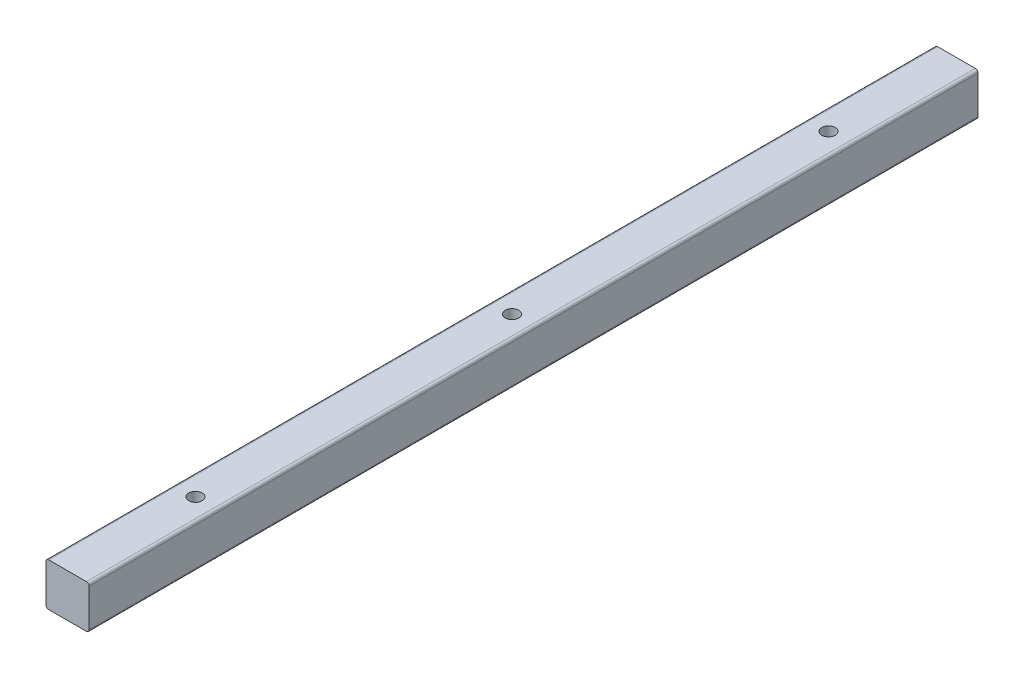
ISO-10303-21;
HEADER;
FILE_DESCRIPTION(('STEP AP214'),'2;1');
FILE_NAME('part.step','',(''),(''),'','','');
FILE_SCHEMA(('AUTOMOTIVE_DESIGN { 1 0 10303 214 1 1 1 1 }'));
ENDSEC;
DATA;
#1=APPLICATION_CONTEXT('core data for automotive mechanical design processes');
#2=APPLICATION_PROTOCOL_DEFINITION('international standard','automotive_design',2000,#1);
#3=PRODUCT_CONTEXT('',#1,'mechanical');
#4=PRODUCT('Part','Part','',(#3));
#5=PRODUCT_RELATED_PRODUCT_CATEGORY('part','',(#4));
#6=PRODUCT_DEFINITION_FORMATION('','',#4);
#7=PRODUCT_DEFINITION_CONTEXT('part definition',#1,'design');
#8=PRODUCT_DEFINITION('design','',#6,#7);
#9=PRODUCT_DEFINITION_SHAPE('','',#8);
#10=(LENGTH_UNIT() NAMED_UNIT(*) SI_UNIT(.MILLI.,.METRE.));
#11=(NAMED_UNIT(*) PLANE_ANGLE_UNIT() SI_UNIT($,.RADIAN.));
#12=(NAMED_UNIT(*) SI_UNIT($,.STERADIAN.) SOLID_ANGLE_UNIT());
#13=UNCERTAINTY_MEASURE_WITH_UNIT(LENGTH_MEASURE(1.E-05),#10,'distance_accuracy_value','');
#14=(GEOMETRIC_REPRESENTATION_CONTEXT(3) GLOBAL_UNCERTAINTY_ASSIGNED_CONTEXT((#13)) GLOBAL_UNIT_ASSIGNED_CONTEXT((#10,
#11,#12)) REPRESENTATION_CONTEXT('',''));
#15=CARTESIAN_POINT('',(0.,0.,0.));
#16=DIRECTION('',(0.,0.,1.));
#17=DIRECTION('',(1.,0.,0.));
#18=AXIS2_PLACEMENT_3D('',#15,#16,#17);
#19=CARTESIAN_POINT('',(-7.,-7.,165.));
#20=DIRECTION('',(0.,0.,-1.));
#21=DIRECTION('',(-1.,0.,0.));
#22=AXIS2_PLACEMENT_3D('',#19,#20,#21);
#23=CYLINDRICAL_SURFACE('',#22,1.);
#24=CARTESIAN_POINT('',(-7.,-7.,-165.));
#25=DIRECTION('',(0.,0.,1.));
#26=DIRECTION('',(-1.,0.,0.));
#27=AXIS2_PLACEMENT_3D('',#24,#25,#26);
#28=CIRCLE('',#27,1.);
#29=CARTESIAN_POINT('',(-8.,-6.99999999999999,-165.));
#30=VERTEX_POINT('',#29);
#31=CARTESIAN_POINT('',(-6.99999999999999,-8.,-165.));
#32=VERTEX_POINT('',#31);
#33=EDGE_CURVE('E135',#30,#32,#28,.T.);
#34=ORIENTED_EDGE('',*,*,#33,.T.);
#35=DIRECTION('',(0.,0.,-1.));
#36=VECTOR('',#35,1.);
#37=CARTESIAN_POINT('',(-6.99999999999999,-8.,165.));
#38=LINE('',#37,#36);
#39=CARTESIAN_POINT('',(-6.99999999999999,-8.,165.));
#40=VERTEX_POINT('',#39);
#41=EDGE_CURVE('E11',#40,#32,#38,.T.);
#42=ORIENTED_EDGE('',*,*,#41,.F.);
#43=CARTESIAN_POINT('',(-7.,-7.,165.));
#44=DIRECTION('',(0.,0.,1.));
#45=DIRECTION('',(-1.,0.,0.));
#46=AXIS2_PLACEMENT_3D('',#43,#44,#45);
#47=CIRCLE('',#46,1.);
#48=CARTESIAN_POINT('',(-8.,-6.99999999999999,165.));
#49=VERTEX_POINT('',#48);
#50=EDGE_CURVE('E150',#49,#40,#47,.T.);
#51=ORIENTED_EDGE('',*,*,#50,.F.);
#52=DIRECTION('',(0.,0.,-1.));
#53=VECTOR('',#52,1.);
#54=CARTESIAN_POINT('',(-8.,-6.99999999999999,165.));
#55=LINE('',#54,#53);
#56=EDGE_CURVE('E131',#49,#30,#55,.T.);
#57=ORIENTED_EDGE('',*,*,#56,.T.);
#58=EDGE_LOOP('',(#34,#42,#51,#57));
#59=FACE_BOUND('',#58,.T.);
#60=ADVANCED_FACE('F36',(#59),#23,.T.);
#61=CARTESIAN_POINT('',(6.99999999999999,-8.,165.));
#62=DIRECTION('',(0.,1.,0.));
#63=DIRECTION('',(-1.,0.,0.));
#64=AXIS2_PLACEMENT_3D('',#61,#62,#63);
#65=PLANE('',#64);
#66=CARTESIAN_POINT('',(0.,-8.,-10.));
#67=DIRECTION('',(0.,-1.,0.));
#68=DIRECTION('',(0.,0.,-1.));
#69=AXIS2_PLACEMENT_3D('',#66,#67,#68);
#70=CIRCLE('',#69,1.25);
#71=CARTESIAN_POINT('',(0.,-8.,-11.25));
#72=VERTEX_POINT('',#71);
#73=EDGE_CURVE('E209',#72,#72,#70,.T.);
#74=ORIENTED_EDGE('',*,*,#73,.F.);
#75=EDGE_LOOP('',(#74));
#76=FACE_BOUND('',#75,.T.);
#77=CARTESIAN_POINT('',(0.,-8.,-50.));
#78=DIRECTION('',(0.,-1.,0.));
#79=DIRECTION('',(0.,0.,-1.));
#80=AXIS2_PLACEMENT_3D('',#77,#78,#79);
#81=CIRCLE('',#80,1.25);
#82=CARTESIAN_POINT('',(0.,-8.,-51.25));
#83=VERTEX_POINT('',#82);
#84=EDGE_CURVE('E203',#83,#83,#81,.T.);
#85=ORIENTED_EDGE('',*,*,#84,.F.);
#86=EDGE_LOOP('',(#85));
#87=FACE_BOUND('',#86,.T.);
#88=DIRECTION('',(1.,0.,0.));
#89=VECTOR('',#88,1.);
#90=CARTESIAN_POINT('',(6.99999999999999,-8.,-165.));
#91=LINE('',#90,#89);
#92=CARTESIAN_POINT('',(6.99999999999999,-8.,-165.));
#93=VERTEX_POINT('',#92);
#94=EDGE_CURVE('E138',#32,#93,#91,.T.);
#95=ORIENTED_EDGE('',*,*,#94,.T.);
#96=DIRECTION('',(0.,0.,-1.));
#97=VECTOR('',#96,1.);
#98=CARTESIAN_POINT('',(6.99999999999999,-8.,165.));
#99=LINE('',#98,#97);
#100=CARTESIAN_POINT('',(6.99999999999999,-8.,165.));
#101=VERTEX_POINT('',#100);
#102=EDGE_CURVE('E44',#101,#93,#99,.T.);
#103=ORIENTED_EDGE('',*,*,#102,.F.);
#104=DIRECTION('',(1.,0.,0.));
#105=VECTOR('',#104,1.);
#106=CARTESIAN_POINT('',(6.99999999999999,-8.,165.));
#107=LINE('',#106,#105);
#108=EDGE_CURVE('E96',#40,#101,#107,.T.);
#109=ORIENTED_EDGE('',*,*,#108,.F.);
#110=ORIENTED_EDGE('',*,*,#41,.T.);
#111=EDGE_LOOP('',(#95,#103,#109,#110));
#112=FACE_BOUND('',#111,.T.);
#113=ADVANCED_FACE('F215',(#76,#87,#112),#65,.F.);
#114=CARTESIAN_POINT('',(7.,-7.,165.));
#115=DIRECTION('',(0.,0.,-1.));
#116=DIRECTION('',(-1.,0.,0.));
#117=AXIS2_PLACEMENT_3D('',#114,#115,#116);
#118=CYLINDRICAL_SURFACE('',#117,1.);
#119=CARTESIAN_POINT('',(7.,-7.,-165.));
#120=DIRECTION('',(0.,0.,1.));
#121=DIRECTION('',(-1.,0.,0.));
#122=AXIS2_PLACEMENT_3D('',#119,#120,#121);
#123=CIRCLE('',#122,1.);
#124=CARTESIAN_POINT('',(8.,-6.99999999999999,-165.));
#125=VERTEX_POINT('',#124);
#126=EDGE_CURVE('E141',#93,#125,#123,.T.);
#127=ORIENTED_EDGE('',*,*,#126,.T.);
#128=DIRECTION('',(0.,0.,-1.));
#129=VECTOR('',#128,1.);
#130=CARTESIAN_POINT('',(8.,-6.99999999999999,165.));
#131=LINE('',#130,#129);
#132=CARTESIAN_POINT('',(8.,-6.99999999999999,165.));
#133=VERTEX_POINT('',#132);
#134=EDGE_CURVE('E157',#133,#125,#131,.T.);
#135=ORIENTED_EDGE('',*,*,#134,.F.);
#136=CARTESIAN_POINT('',(7.,-7.,165.));
#137=DIRECTION('',(0.,0.,1.));
#138=DIRECTION('',(-1.,0.,0.));
#139=AXIS2_PLACEMENT_3D('',#136,#137,#138);
#140=CIRCLE('',#139,1.);
#141=EDGE_CURVE('E165',#101,#133,#140,.T.);
#142=ORIENTED_EDGE('',*,*,#141,.F.);
#143=ORIENTED_EDGE('',*,*,#102,.T.);
#144=EDGE_LOOP('',(#127,#135,#142,#143));
#145=FACE_BOUND('',#144,.T.);
#146=ADVANCED_FACE('F163',(#145),#118,.T.);
#147=CARTESIAN_POINT('',(8.,6.99999999999999,165.));
#148=DIRECTION('',(-1.,0.,0.));
#149=DIRECTION('',(0.,-1.,0.));
#150=AXIS2_PLACEMENT_3D('',#147,#148,#149);
#151=PLANE('',#150);
#152=DIRECTION('',(0.,1.,0.));
#153=VECTOR('',#152,1.);
#154=CARTESIAN_POINT('',(8.,6.99999999999999,-165.));
#155=LINE('',#154,#153);
#156=CARTESIAN_POINT('',(8.,6.99999999999999,-165.));
#157=VERTEX_POINT('',#156);
#158=EDGE_CURVE('E143',#125,#157,#155,.T.);
#159=ORIENTED_EDGE('',*,*,#158,.T.);
#160=DIRECTION('',(0.,0.,-1.));
#161=VECTOR('',#160,1.);
#162=CARTESIAN_POINT('',(8.,6.99999999999999,165.));
#163=LINE('',#162,#161);
#164=CARTESIAN_POINT('',(8.,6.99999999999999,165.));
#165=VERTEX_POINT('',#164);
#166=EDGE_CURVE('E154',#165,#157,#163,.T.);
#167=ORIENTED_EDGE('',*,*,#166,.F.);
#168=DIRECTION('',(0.,1.,0.));
#169=VECTOR('',#168,1.);
#170=CARTESIAN_POINT('',(8.,6.99999999999999,165.));
#171=LINE('',#170,#169);
#172=EDGE_CURVE('E177',#133,#165,#171,.T.);
#173=ORIENTED_EDGE('',*,*,#172,.F.);
#174=ORIENTED_EDGE('',*,*,#134,.T.);
#175=EDGE_LOOP('',(#159,#167,#173,#174));
#176=FACE_BOUND('',#175,.T.);
#177=ADVANCED_FACE('F173',(#176),#151,.F.);
#178=CARTESIAN_POINT('',(7.,7.,165.));
#179=DIRECTION('',(0.,0.,-1.));
#180=DIRECTION('',(-1.,0.,0.));
#181=AXIS2_PLACEMENT_3D('',#178,#179,#180);
#182=CYLINDRICAL_SURFACE('',#181,1.);
#183=CARTESIAN_POINT('',(7.,7.,-165.));
#184=DIRECTION('',(0.,0.,1.));
#185=DIRECTION('',(-1.,0.,0.));
#186=AXIS2_PLACEMENT_3D('',#183,#184,#185);
#187=CIRCLE('',#186,1.);
#188=CARTESIAN_POINT('',(6.99999999999999,8.,-165.));
#189=VERTEX_POINT('',#188);
#190=EDGE_CURVE('E145',#157,#189,#187,.T.);
#191=ORIENTED_EDGE('',*,*,#190,.T.);
#192=DIRECTION('',(0.,0.,-1.));
#193=VECTOR('',#192,1.);
#194=CARTESIAN_POINT('',(6.99999999999999,8.,165.));
#195=LINE('',#194,#193);
#196=CARTESIAN_POINT('',(6.99999999999999,8.,165.));
#197=VERTEX_POINT('',#196);
#198=EDGE_CURVE('E126',#197,#189,#195,.T.);
#199=ORIENTED_EDGE('',*,*,#198,.F.);
#200=CARTESIAN_POINT('',(7.,7.,165.));
#201=DIRECTION('',(0.,0.,1.));
#202=DIRECTION('',(-1.,0.,0.));
#203=AXIS2_PLACEMENT_3D('',#200,#201,#202);
#204=CIRCLE('',#203,1.);
#205=EDGE_CURVE('E117',#165,#197,#204,.T.);
#206=ORIENTED_EDGE('',*,*,#205,.F.);
#207=ORIENTED_EDGE('',*,*,#166,.T.);
#208=EDGE_LOOP('',(#191,#199,#206,#207));
#209=FACE_BOUND('',#208,.T.);
#210=ADVANCED_FACE('F176',(#209),#182,.T.);
#211=CARTESIAN_POINT('',(6.99999999999999,8.,165.));
#212=DIRECTION('',(0.,-1.,0.));
#213=DIRECTION('',(0.,0.,-1.));
#214=AXIS2_PLACEMENT_3D('',#211,#212,#213);
#215=PLANE('',#214);
#216=CARTESIAN_POINT('',(0.,8.,0.));
#217=DIRECTION('',(0.,1.,0.));
#218=DIRECTION('',(0.,0.,1.));
#219=AXIS2_PLACEMENT_3D('',#216,#217,#218);
#220=CIRCLE('',#219,2.49999999999999);
#221=CARTESIAN_POINT('',(0.,8.,2.49999999999999));
#222=VERTEX_POINT('',#221);
#223=EDGE_CURVE('E197',#222,#222,#220,.T.);
#224=ORIENTED_EDGE('',*,*,#223,.F.);
#225=EDGE_LOOP('',(#224));
#226=FACE_BOUND('',#225,.T.);
#227=CARTESIAN_POINT('',(0.,8.,-117.5));
#228=DIRECTION('',(0.,1.,0.));
#229=DIRECTION('',(0.,0.,1.));
#230=AXIS2_PLACEMENT_3D('',#227,#228,#229);
#231=CIRCLE('',#230,2.49999999999999);
#232=CARTESIAN_POINT('',(0.,8.,-115.));
#233=VERTEX_POINT('',#232);
#234=EDGE_CURVE('E191',#233,#233,#231,.T.);
#235=ORIENTED_EDGE('',*,*,#234,.F.);
#236=EDGE_LOOP('',(#235));
#237=FACE_BOUND('',#236,.T.);
#238=CARTESIAN_POINT('',(0.,8.,117.5));
#239=DIRECTION('',(0.,1.,0.));
#240=DIRECTION('',(0.,0.,1.));
#241=AXIS2_PLACEMENT_3D('',#238,#239,#240);
#242=CIRCLE('',#241,2.49999999999999);
#243=CARTESIAN_POINT('',(0.,8.,120.));
#244=VERTEX_POINT('',#243);
#245=EDGE_CURVE('E185',#244,#244,#242,.T.);
#246=ORIENTED_EDGE('',*,*,#245,.F.);
#247=EDGE_LOOP('',(#246));
#248=FACE_BOUND('',#247,.T.);
#249=DIRECTION('',(-1.,0.,0.));
#250=VECTOR('',#249,1.);
#251=CARTESIAN_POINT('',(6.99999999999999,8.,-165.));
#252=LINE('',#251,#250);
#253=CARTESIAN_POINT('',(-7.,8.,-165.));
#254=VERTEX_POINT('',#253);
#255=EDGE_CURVE('E125',#189,#254,#252,.T.);
#256=ORIENTED_EDGE('',*,*,#255,.T.);
#257=DIRECTION('',(0.,0.,-1.));
#258=VECTOR('',#257,1.);
#259=CARTESIAN_POINT('',(-7.,8.,165.));
#260=LINE('',#259,#258);
#261=CARTESIAN_POINT('',(-7.,8.,165.));
#262=VERTEX_POINT('',#261);
#263=EDGE_CURVE('E122',#262,#254,#260,.T.);
#264=ORIENTED_EDGE('',*,*,#263,.F.);
#265=DIRECTION('',(-1.,0.,0.));
#266=VECTOR('',#265,1.);
#267=CARTESIAN_POINT('',(6.99999999999999,8.,165.));
#268=LINE('',#267,#266);
#269=EDGE_CURVE('E111',#197,#262,#268,.T.);
#270=ORIENTED_EDGE('',*,*,#269,.F.);
#271=ORIENTED_EDGE('',*,*,#198,.T.);
#272=EDGE_LOOP('',(#256,#264,#270,#271));
#273=FACE_BOUND('',#272,.T.);
#274=ADVANCED_FACE('F123',(#226,#237,#248,#273),#215,.F.);
#275=CARTESIAN_POINT('',(-7.,7.,165.));
#276=DIRECTION('',(0.,0.,-1.));
#277=DIRECTION('',(-1.,0.,0.));
#278=AXIS2_PLACEMENT_3D('',#275,#276,#277);
#279=CYLINDRICAL_SURFACE('',#278,1.);
#280=CARTESIAN_POINT('',(-7.,7.,-165.));
#281=DIRECTION('',(0.,0.,1.));
#282=DIRECTION('',(1.,0.,0.));
#283=AXIS2_PLACEMENT_3D('',#280,#281,#282);
#284=CIRCLE('',#283,1.);
#285=CARTESIAN_POINT('',(-8.,6.99999999999999,-165.));
#286=VERTEX_POINT('',#285);
#287=EDGE_CURVE('E82',#254,#286,#284,.T.);
#288=ORIENTED_EDGE('',*,*,#287,.T.);
#289=DIRECTION('',(0.,0.,-1.));
#290=VECTOR('',#289,1.);
#291=CARTESIAN_POINT('',(-8.,6.99999999999999,165.));
#292=LINE('',#291,#290);
#293=CARTESIAN_POINT('',(-8.,6.99999999999999,165.));
#294=VERTEX_POINT('',#293);
#295=EDGE_CURVE('E127',#294,#286,#292,.T.);
#296=ORIENTED_EDGE('',*,*,#295,.F.);
#297=CARTESIAN_POINT('',(-7.,7.,165.));
#298=DIRECTION('',(0.,0.,1.));
#299=DIRECTION('',(1.,0.,0.));
#300=AXIS2_PLACEMENT_3D('',#297,#298,#299);
#301=CIRCLE('',#300,1.);
#302=EDGE_CURVE('E115',#262,#294,#301,.T.);
#303=ORIENTED_EDGE('',*,*,#302,.F.);
#304=ORIENTED_EDGE('',*,*,#263,.T.);
#305=EDGE_LOOP('',(#288,#296,#303,#304));
#306=FACE_BOUND('',#305,.T.);
#307=ADVANCED_FACE('F129',(#306),#279,.T.);
#308=CARTESIAN_POINT('',(-8.,6.99999999999999,165.));
#309=DIRECTION('',(1.,0.,0.));
#310=DIRECTION('',(0.,1.,0.));
#311=AXIS2_PLACEMENT_3D('',#308,#309,#310);
#312=PLANE('',#311);
#313=DIRECTION('',(0.,-1.,0.));
#314=VECTOR('',#313,1.);
#315=CARTESIAN_POINT('',(-8.,6.99999999999999,-165.));
#316=LINE('',#315,#314);
#317=EDGE_CURVE('E88',#286,#30,#316,.T.);
#318=ORIENTED_EDGE('',*,*,#317,.T.);
#319=ORIENTED_EDGE('',*,*,#56,.F.);
#320=DIRECTION('',(0.,-1.,0.));
#321=VECTOR('',#320,1.);
#322=CARTESIAN_POINT('',(-8.,6.99999999999999,165.));
#323=LINE('',#322,#321);
#324=EDGE_CURVE('E52',#294,#49,#323,.T.);
#325=ORIENTED_EDGE('',*,*,#324,.F.);
#326=ORIENTED_EDGE('',*,*,#295,.T.);
#327=EDGE_LOOP('',(#318,#319,#325,#326));
#328=FACE_BOUND('',#327,.T.);
#329=ADVANCED_FACE('F222',(#328),#312,.F.);
#330=CARTESIAN_POINT('',(-7.,-7.,165.));
#331=DIRECTION('',(0.,0.,-1.));
#332=DIRECTION('',(-1.,0.,0.));
#333=AXIS2_PLACEMENT_3D('',#330,#331,#332);
#334=PLANE('',#333);
#335=ORIENTED_EDGE('',*,*,#50,.T.);
#336=ORIENTED_EDGE('',*,*,#108,.T.);
#337=ORIENTED_EDGE('',*,*,#141,.T.);
#338=ORIENTED_EDGE('',*,*,#172,.T.);
#339=ORIENTED_EDGE('',*,*,#205,.T.);
#340=ORIENTED_EDGE('',*,*,#269,.T.);
#341=ORIENTED_EDGE('',*,*,#302,.T.);
#342=ORIENTED_EDGE('',*,*,#324,.T.);
#343=EDGE_LOOP('',(#335,#336,#337,#338,#339,#340,#341,#342));
#344=FACE_BOUND('',#343,.T.);
#345=ADVANCED_FACE('F113',(#344),#334,.F.);
#346=CARTESIAN_POINT('',(-7.,-7.,-165.));
#347=DIRECTION('',(0.,0.,-1.));
#348=DIRECTION('',(-1.,0.,0.));
#349=AXIS2_PLACEMENT_3D('',#346,#347,#348);
#350=PLANE('',#349);
#351=ORIENTED_EDGE('',*,*,#33,.F.);
#352=ORIENTED_EDGE('',*,*,#317,.F.);
#353=ORIENTED_EDGE('',*,*,#287,.F.);
#354=ORIENTED_EDGE('',*,*,#255,.F.);
#355=ORIENTED_EDGE('',*,*,#190,.F.);
#356=ORIENTED_EDGE('',*,*,#158,.F.);
#357=ORIENTED_EDGE('',*,*,#126,.F.);
#358=ORIENTED_EDGE('',*,*,#94,.F.);
#359=EDGE_LOOP('',(#351,#352,#353,#354,#355,#356,#357,#358));
#360=FACE_BOUND('',#359,.T.);
#361=ADVANCED_FACE('F169',(#360),#350,.T.);
#362=CARTESIAN_POINT('',(0.,-5.,117.5));
#363=DIRECTION('',(0.,1.,0.));
#364=DIRECTION('',(0.,0.,1.));
#365=AXIS2_PLACEMENT_3D('',#362,#363,#364);
#366=CONICAL_SURFACE('',#365,2.5,1.02974425867665);
#367=CARTESIAN_POINT('',(0.,-6.5021515475689,117.5));
#368=VERTEX_POINT('',#367);
#369=VERTEX_LOOP('',#368);
#370=FACE_BOUND('',#369,.T.);
#371=CARTESIAN_POINT('',(0.,-5.,117.5));
#372=DIRECTION('',(0.,1.,0.));
#373=DIRECTION('',(0.,0.,1.));
#374=AXIS2_PLACEMENT_3D('',#371,#372,#373);
#375=CIRCLE('',#374,2.5);
#376=CARTESIAN_POINT('',(0.,-5.,120.));
#377=VERTEX_POINT('',#376);
#378=EDGE_CURVE('E139',#377,#377,#375,.T.);
#379=ORIENTED_EDGE('',*,*,#378,.T.);
#380=EDGE_LOOP('',(#379));
#381=FACE_BOUND('',#380,.T.);
#382=ADVANCED_FACE('F293',(#370,#381),#366,.F.);
#383=CARTESIAN_POINT('',(0.,8.,117.5));
#384=DIRECTION('',(0.,1.,0.));
#385=DIRECTION('',(0.,0.,1.));
#386=AXIS2_PLACEMENT_3D('',#383,#384,#385);
#387=CYLINDRICAL_SURFACE('',#386,2.49999999999999);
#388=ORIENTED_EDGE('',*,*,#378,.F.);
#389=EDGE_LOOP('',(#388));
#390=FACE_BOUND('',#389,.T.);
#391=ORIENTED_EDGE('',*,*,#245,.T.);
#392=EDGE_LOOP('',(#391));
#393=FACE_BOUND('',#392,.T.);
#394=ADVANCED_FACE('F301',(#390,#393),#387,.F.);
#395=CARTESIAN_POINT('',(0.,-5.,-117.5));
#396=DIRECTION('',(0.,1.,0.));
#397=DIRECTION('',(0.,0.,1.));
#398=AXIS2_PLACEMENT_3D('',#395,#396,#397);
#399=CONICAL_SURFACE('',#398,2.5,1.02974425867665);
#400=CARTESIAN_POINT('',(0.,-6.5021515475689,-117.5));
#401=VERTEX_POINT('',#400);
#402=VERTEX_LOOP('',#401);
#403=FACE_BOUND('',#402,.T.);
#404=CARTESIAN_POINT('',(0.,-5.,-117.5));
#405=DIRECTION('',(0.,1.,0.));
#406=DIRECTION('',(0.,0.,1.));
#407=AXIS2_PLACEMENT_3D('',#404,#405,#406);
#408=CIRCLE('',#407,2.5);
#409=CARTESIAN_POINT('',(0.,-5.,-115.));
#410=VERTEX_POINT('',#409);
#411=EDGE_CURVE('E188',#410,#410,#408,.T.);
#412=ORIENTED_EDGE('',*,*,#411,.T.);
#413=EDGE_LOOP('',(#412));
#414=FACE_BOUND('',#413,.T.);
#415=ADVANCED_FACE('F309',(#403,#414),#399,.F.);
#416=CARTESIAN_POINT('',(0.,8.,-117.5));
#417=DIRECTION('',(0.,1.,0.));
#418=DIRECTION('',(0.,0.,1.));
#419=AXIS2_PLACEMENT_3D('',#416,#417,#418);
#420=CYLINDRICAL_SURFACE('',#419,2.49999999999999);
#421=ORIENTED_EDGE('',*,*,#411,.F.);
#422=EDGE_LOOP('',(#421));
#423=FACE_BOUND('',#422,.T.);
#424=ORIENTED_EDGE('',*,*,#234,.T.);
#425=EDGE_LOOP('',(#424));
#426=FACE_BOUND('',#425,.T.);
#427=ADVANCED_FACE('F318',(#423,#426),#420,.F.);
#428=CARTESIAN_POINT('',(0.,-5.,0.));
#429=DIRECTION('',(0.,1.,0.));
#430=DIRECTION('',(0.,0.,1.));
#431=AXIS2_PLACEMENT_3D('',#428,#429,#430);
#432=CONICAL_SURFACE('',#431,2.5,1.02974425867665);
#433=CARTESIAN_POINT('',(0.,-6.5021515475689,0.));
#434=VERTEX_POINT('',#433);
#435=VERTEX_LOOP('',#434);
#436=FACE_BOUND('',#435,.T.);
#437=CARTESIAN_POINT('',(0.,-5.,0.));
#438=DIRECTION('',(0.,1.,0.));
#439=DIRECTION('',(0.,0.,1.));
#440=AXIS2_PLACEMENT_3D('',#437,#438,#439);
#441=CIRCLE('',#440,2.5);
#442=CARTESIAN_POINT('',(0.,-5.,2.5));
#443=VERTEX_POINT('',#442);
#444=EDGE_CURVE('E194',#443,#443,#441,.T.);
#445=ORIENTED_EDGE('',*,*,#444,.T.);
#446=EDGE_LOOP('',(#445));
#447=FACE_BOUND('',#446,.T.);
#448=ADVANCED_FACE('F326',(#436,#447),#432,.F.);
#449=CARTESIAN_POINT('',(0.,8.,0.));
#450=DIRECTION('',(0.,1.,0.));
#451=DIRECTION('',(0.,0.,1.));
#452=AXIS2_PLACEMENT_3D('',#449,#450,#451);
#453=CYLINDRICAL_SURFACE('',#452,2.49999999999999);
#454=ORIENTED_EDGE('',*,*,#444,.F.);
#455=EDGE_LOOP('',(#454));
#456=FACE_BOUND('',#455,.T.);
#457=ORIENTED_EDGE('',*,*,#223,.T.);
#458=EDGE_LOOP('',(#457));
#459=FACE_BOUND('',#458,.T.);
#460=ADVANCED_FACE('F335',(#456,#459),#453,.F.);
#461=CARTESIAN_POINT('',(0.,0.5,-50.));
#462=DIRECTION('',(0.,-1.,0.));
#463=DIRECTION('',(0.,0.,-1.));
#464=AXIS2_PLACEMENT_3D('',#461,#462,#463);
#465=CONICAL_SURFACE('',#464,1.25,1.02974425867665);
#466=CARTESIAN_POINT('',(0.,1.25107577378445,-50.));
#467=VERTEX_POINT('',#466);
#468=VERTEX_LOOP('',#467);
#469=FACE_BOUND('',#468,.T.);
#470=CARTESIAN_POINT('',(0.,0.5,-50.));
#471=DIRECTION('',(0.,-1.,0.));
#472=DIRECTION('',(0.,0.,-1.));
#473=AXIS2_PLACEMENT_3D('',#470,#471,#472);
#474=CIRCLE('',#473,1.25);
#475=CARTESIAN_POINT('',(0.,0.5,-51.25));
#476=VERTEX_POINT('',#475);
#477=EDGE_CURVE('E200',#476,#476,#474,.T.);
#478=ORIENTED_EDGE('',*,*,#477,.T.);
#479=EDGE_LOOP('',(#478));
#480=FACE_BOUND('',#479,.T.);
#481=ADVANCED_FACE('F342',(#469,#480),#465,.F.);
#482=CARTESIAN_POINT('',(0.,-8.,-50.));
#483=DIRECTION('',(0.,-1.,0.));
#484=DIRECTION('',(0.,0.,-1.));
#485=AXIS2_PLACEMENT_3D('',#482,#483,#484);
#486=CYLINDRICAL_SURFACE('',#485,1.25);
#487=ORIENTED_EDGE('',*,*,#477,.F.);
#488=EDGE_LOOP('',(#487));
#489=FACE_BOUND('',#488,.T.);
#490=ORIENTED_EDGE('',*,*,#84,.T.);
#491=EDGE_LOOP('',(#490));
#492=FACE_BOUND('',#491,.T.);
#493=ADVANCED_FACE('F349',(#489,#492),#486,.F.);
#494=CARTESIAN_POINT('',(0.,0.5,-10.));
#495=DIRECTION('',(0.,-1.,0.));
#496=DIRECTION('',(0.,0.,-1.));
#497=AXIS2_PLACEMENT_3D('',#494,#495,#496);
#498=CONICAL_SURFACE('',#497,1.25,1.02974425867665);
#499=CARTESIAN_POINT('',(0.,1.25107577378445,-10.));
#500=VERTEX_POINT('',#499);
#501=VERTEX_LOOP('',#500);
#502=FACE_BOUND('',#501,.T.);
#503=CARTESIAN_POINT('',(0.,0.5,-10.));
#504=DIRECTION('',(0.,-1.,0.));
#505=DIRECTION('',(0.,0.,-1.));
#506=AXIS2_PLACEMENT_3D('',#503,#504,#505);
#507=CIRCLE('',#506,1.25);
#508=CARTESIAN_POINT('',(0.,0.5,-11.25));
#509=VERTEX_POINT('',#508);
#510=EDGE_CURVE('E206',#509,#509,#507,.T.);
#511=ORIENTED_EDGE('',*,*,#510,.T.);
#512=EDGE_LOOP('',(#511));
#513=FACE_BOUND('',#512,.T.);
#514=ADVANCED_FACE('F358',(#502,#513),#498,.F.);
#515=CARTESIAN_POINT('',(0.,-8.,-10.));
#516=DIRECTION('',(0.,-1.,0.));
#517=DIRECTION('',(0.,0.,-1.));
#518=AXIS2_PLACEMENT_3D('',#515,#516,#517);
#519=CYLINDRICAL_SURFACE('',#518,1.25);
#520=ORIENTED_EDGE('',*,*,#510,.F.);
#521=EDGE_LOOP('',(#520));
#522=FACE_BOUND('',#521,.T.);
#523=ORIENTED_EDGE('',*,*,#73,.T.);
#524=EDGE_LOOP('',(#523));
#525=FACE_BOUND('',#524,.T.);
#526=ADVANCED_FACE('F213',(#522,#525),#519,.F.);
#527=CLOSED_SHELL('',(#60,#113,#146,#177,#210,#274,#307,#329,#345,#361,#382,#394,#415,#427,#448,
#460,#481,#493,#514,#526));
#528=MANIFOLD_SOLID_BREP('B2',#527);
#529=ADVANCED_BREP_SHAPE_REPRESENTATION('',(#18,#528),#14);
#530=SHAPE_DEFINITION_REPRESENTATION(#9,#529);
ENDSEC;
END-ISO-10303-21;
